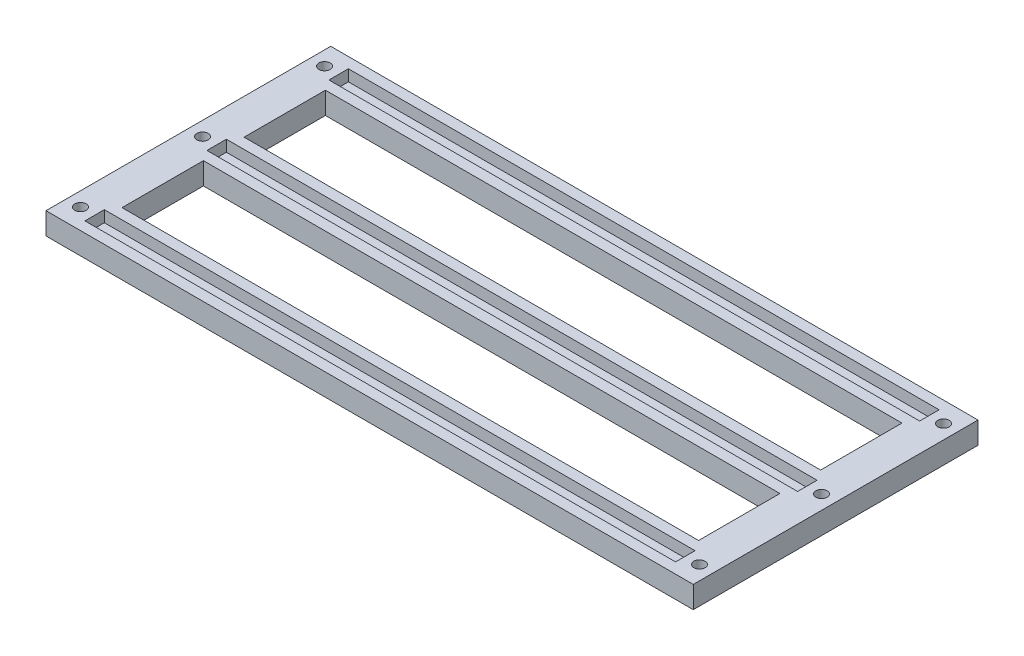
ISO-10303-21;
HEADER;
FILE_DESCRIPTION(('STEP AP214'),'2;1');
FILE_NAME('part.step','',(''),(''),'','','');
FILE_SCHEMA(('AUTOMOTIVE_DESIGN { 1 0 10303 214 1 1 1 1 }'));
ENDSEC;
DATA;
#1=APPLICATION_CONTEXT('core data for automotive mechanical design processes');
#2=APPLICATION_PROTOCOL_DEFINITION('international standard','automotive_design',2000,#1);
#3=PRODUCT_CONTEXT('',#1,'mechanical');
#4=PRODUCT('Part','Part','',(#3));
#5=PRODUCT_RELATED_PRODUCT_CATEGORY('part','',(#4));
#6=PRODUCT_DEFINITION_FORMATION('','',#4);
#7=PRODUCT_DEFINITION_CONTEXT('part definition',#1,'design');
#8=PRODUCT_DEFINITION('design','',#6,#7);
#9=PRODUCT_DEFINITION_SHAPE('','',#8);
#10=(LENGTH_UNIT() NAMED_UNIT(*) SI_UNIT(.MILLI.,.METRE.));
#11=(NAMED_UNIT(*) PLANE_ANGLE_UNIT() SI_UNIT($,.RADIAN.));
#12=(NAMED_UNIT(*) SI_UNIT($,.STERADIAN.) SOLID_ANGLE_UNIT());
#13=UNCERTAINTY_MEASURE_WITH_UNIT(LENGTH_MEASURE(1.E-05),#10,'distance_accuracy_value','');
#14=(GEOMETRIC_REPRESENTATION_CONTEXT(3) GLOBAL_UNCERTAINTY_ASSIGNED_CONTEXT((#13)) GLOBAL_UNIT_ASSIGNED_CONTEXT((#10,
#11,#12)) REPRESENTATION_CONTEXT('',''));
#15=CARTESIAN_POINT('',(0.,0.,0.));
#16=DIRECTION('',(0.,0.,1.));
#17=DIRECTION('',(1.,0.,0.));
#18=AXIS2_PLACEMENT_3D('',#15,#16,#17);
#19=CARTESIAN_POINT('',(-4.18172630706234E-13,3.2,-40.25));
#20=DIRECTION('',(0.,0.,-1.));
#21=DIRECTION('',(-1.,0.,0.));
#22=AXIS2_PLACEMENT_3D('',#19,#20,#21);
#23=PLANE('',#22);
#24=DIRECTION('',(0.,-1.,0.));
#25=VECTOR('',#24,1.);
#26=CARTESIAN_POINT('',(91.4999999999996,3.2,-40.250000000001));
#27=LINE('',#26,#25);
#28=CARTESIAN_POINT('',(91.4999999999996,3.2,-40.250000000001));
#29=VERTEX_POINT('',#28);
#30=CARTESIAN_POINT('',(91.4999999999996,-3.,-40.250000000001));
#31=VERTEX_POINT('',#30);
#32=EDGE_CURVE('E266',#29,#31,#27,.T.);
#33=ORIENTED_EDGE('',*,*,#32,.T.);
#34=DIRECTION('',(1.,0.,0.));
#35=VECTOR('',#34,1.);
#36=CARTESIAN_POINT('',(-4.18172630706234E-13,-3.,-40.25));
#37=LINE('',#36,#35);
#38=CARTESIAN_POINT('',(-91.5000000000004,-3.,-40.249999999999));
#39=VERTEX_POINT('',#38);
#40=EDGE_CURVE('E401',#39,#31,#37,.T.);
#41=ORIENTED_EDGE('',*,*,#40,.F.);
#42=DIRECTION('',(0.,-1.,0.));
#43=VECTOR('',#42,1.);
#44=CARTESIAN_POINT('',(-91.5000000000004,3.2,-40.249999999999));
#45=LINE('',#44,#43);
#46=CARTESIAN_POINT('',(-91.5000000000004,3.2,-40.249999999999));
#47=VERTEX_POINT('',#46);
#48=EDGE_CURVE('E11',#47,#39,#45,.T.);
#49=ORIENTED_EDGE('',*,*,#48,.F.);
#50=DIRECTION('',(1.,0.,0.));
#51=VECTOR('',#50,1.);
#52=CARTESIAN_POINT('',(-4.18172630706234E-13,3.2,-40.25));
#53=LINE('',#52,#51);
#54=EDGE_CURVE('E188',#47,#29,#53,.T.);
#55=ORIENTED_EDGE('',*,*,#54,.T.);
#56=EDGE_LOOP('',(#33,#41,#49,#55));
#57=FACE_BOUND('',#56,.T.);
#58=ADVANCED_FACE('F47',(#57),#23,.T.);
#59=CARTESIAN_POINT('',(-91.5,3.2,9.46447889004986E-13));
#60=DIRECTION('',(-1.,0.,0.));
#61=DIRECTION('',(0.,0.,1.));
#62=AXIS2_PLACEMENT_3D('',#59,#60,#61);
#63=PLANE('',#62);
#64=ORIENTED_EDGE('',*,*,#48,.T.);
#65=DIRECTION('',(0.,0.,-1.));
#66=VECTOR('',#65,1.);
#67=CARTESIAN_POINT('',(-91.5,-3.,9.46447889004986E-13));
#68=LINE('',#67,#66);
#69=CARTESIAN_POINT('',(-91.4999999999996,-3.,40.250000000001));
#70=VERTEX_POINT('',#69);
#71=EDGE_CURVE('E172',#70,#39,#68,.T.);
#72=ORIENTED_EDGE('',*,*,#71,.F.);
#73=DIRECTION('',(0.,-1.,0.));
#74=VECTOR('',#73,1.);
#75=CARTESIAN_POINT('',(-91.4999999999996,3.2,40.250000000001));
#76=LINE('',#75,#74);
#77=CARTESIAN_POINT('',(-91.4999999999996,3.2,40.250000000001));
#78=VERTEX_POINT('',#77);
#79=EDGE_CURVE('E58',#78,#70,#76,.T.);
#80=ORIENTED_EDGE('',*,*,#79,.F.);
#81=DIRECTION('',(0.,0.,-1.));
#82=VECTOR('',#81,1.);
#83=CARTESIAN_POINT('',(-91.5,3.2,9.46447889004986E-13));
#84=LINE('',#83,#82);
#85=EDGE_CURVE('E169',#78,#47,#84,.T.);
#86=ORIENTED_EDGE('',*,*,#85,.T.);
#87=EDGE_LOOP('',(#64,#72,#80,#86));
#88=FACE_BOUND('',#87,.T.);
#89=ADVANCED_FACE('F167',(#88),#63,.T.);
#90=CARTESIAN_POINT('',(4.18172630706234E-13,3.2,40.25));
#91=DIRECTION('',(0.,0.,-1.));
#92=DIRECTION('',(-1.,0.,0.));
#93=AXIS2_PLACEMENT_3D('',#90,#91,#92);
#94=PLANE('',#93);
#95=ORIENTED_EDGE('',*,*,#79,.T.);
#96=DIRECTION('',(1.,0.,0.));
#97=VECTOR('',#96,1.);
#98=CARTESIAN_POINT('',(4.18172630706234E-13,-3.,40.25));
#99=LINE('',#98,#97);
#100=CARTESIAN_POINT('',(91.5000000000004,-3.,40.249999999999));
#101=VERTEX_POINT('',#100);
#102=EDGE_CURVE('E403',#70,#101,#99,.T.);
#103=ORIENTED_EDGE('',*,*,#102,.T.);
#104=DIRECTION('',(0.,-1.,0.));
#105=VECTOR('',#104,1.);
#106=CARTESIAN_POINT('',(91.5000000000004,3.2,40.249999999999));
#107=LINE('',#106,#105);
#108=CARTESIAN_POINT('',(91.5000000000004,3.2,40.249999999999));
#109=VERTEX_POINT('',#108);
#110=EDGE_CURVE('E177',#109,#101,#107,.T.);
#111=ORIENTED_EDGE('',*,*,#110,.F.);
#112=DIRECTION('',(1.,0.,0.));
#113=VECTOR('',#112,1.);
#114=CARTESIAN_POINT('',(4.18172630706234E-13,3.2,40.25));
#115=LINE('',#114,#113);
#116=EDGE_CURVE('E180',#78,#109,#115,.T.);
#117=ORIENTED_EDGE('',*,*,#116,.F.);
#118=EDGE_LOOP('',(#95,#103,#111,#117));
#119=FACE_BOUND('',#118,.T.);
#120=ADVANCED_FACE('F181',(#119),#94,.F.);
#121=CARTESIAN_POINT('',(2.61067209517773E-11,3.2,-31.7500000000659));
#122=DIRECTION('',(8.22258927613325E-13,0.,-1.));
#123=DIRECTION('',(-1.,0.,-8.22258927613325E-13));
#124=AXIS2_PLACEMENT_3D('',#121,#122,#123);
#125=PLANE('',#124);
#126=DIRECTION('',(1.,0.,8.22258927613325E-13));
#127=VECTOR('',#126,1.);
#128=CARTESIAN_POINT('',(2.61067209517773E-11,0.,-31.7500000000659));
#129=LINE('',#128,#127);
#130=CARTESIAN_POINT('',(-83.5000000000002,0.,-31.7499999999964));
#131=VERTEX_POINT('',#130);
#132=CARTESIAN_POINT('',(83.4999999999996,0.,-31.7499999999972));
#133=VERTEX_POINT('',#132);
#134=EDGE_CURVE('E252',#131,#133,#129,.T.);
#135=ORIENTED_EDGE('',*,*,#134,.F.);
#136=DIRECTION('',(0.,-1.,0.));
#137=VECTOR('',#136,1.);
#138=CARTESIAN_POINT('',(-83.5000000000002,3.2,-31.7499999999964));
#139=LINE('',#138,#137);
#140=CARTESIAN_POINT('',(-83.5000000000002,3.2,-31.7499999999964));
#141=VERTEX_POINT('',#140);
#142=EDGE_CURVE('E270',#141,#131,#139,.T.);
#143=ORIENTED_EDGE('',*,*,#142,.F.);
#144=DIRECTION('',(1.,0.,8.22258927613325E-13));
#145=VECTOR('',#144,1.);
#146=CARTESIAN_POINT('',(2.61067209517773E-11,3.2,-31.7500000000659));
#147=LINE('',#146,#145);
#148=CARTESIAN_POINT('',(83.4999999999996,3.2,-31.7499999999972));
#149=VERTEX_POINT('',#148);
#150=EDGE_CURVE('E525',#141,#149,#147,.T.);
#151=ORIENTED_EDGE('',*,*,#150,.T.);
#152=DIRECTION('',(0.,-1.,0.));
#153=VECTOR('',#152,1.);
#154=CARTESIAN_POINT('',(83.4999999999996,3.2,-31.7499999999972));
#155=LINE('',#154,#153);
#156=EDGE_CURVE('E273',#149,#133,#155,.T.);
#157=ORIENTED_EDGE('',*,*,#156,.T.);
#158=EDGE_LOOP('',(#135,#143,#151,#157));
#159=FACE_BOUND('',#158,.T.);
#160=ADVANCED_FACE('F553',(#159),#125,.T.);
#161=CARTESIAN_POINT('',(-83.4999999999999,3.2,8.42760205056368E-13));
#162=DIRECTION('',(-1.,0.,0.));
#163=DIRECTION('',(0.,0.,1.));
#164=AXIS2_PLACEMENT_3D('',#161,#162,#163);
#165=PLANE('',#164);
#166=DIRECTION('',(0.,0.,-1.));
#167=VECTOR('',#166,1.);
#168=CARTESIAN_POINT('',(-83.4999999999999,0.,8.42760205056368E-13));
#169=LINE('',#168,#167);
#170=CARTESIAN_POINT('',(-83.5000000000003,0.,-37.2499999999964));
#171=VERTEX_POINT('',#170);
#172=EDGE_CURVE('E256',#131,#171,#169,.T.);
#173=ORIENTED_EDGE('',*,*,#172,.T.);
#174=DIRECTION('',(0.,-1.,0.));
#175=VECTOR('',#174,1.);
#176=CARTESIAN_POINT('',(-83.5000000000003,3.2,-37.2499999999964));
#177=LINE('',#176,#175);
#178=CARTESIAN_POINT('',(-83.5000000000003,3.2,-37.2499999999964));
#179=VERTEX_POINT('',#178);
#180=EDGE_CURVE('E282',#179,#171,#177,.T.);
#181=ORIENTED_EDGE('',*,*,#180,.F.);
#182=DIRECTION('',(0.,0.,-1.));
#183=VECTOR('',#182,1.);
#184=CARTESIAN_POINT('',(-83.4999999999999,3.2,8.42760205056368E-13));
#185=LINE('',#184,#183);
#186=EDGE_CURVE('E529',#141,#179,#185,.T.);
#187=ORIENTED_EDGE('',*,*,#186,.F.);
#188=ORIENTED_EDGE('',*,*,#142,.T.);
#189=EDGE_LOOP('',(#173,#181,#187,#188));
#190=FACE_BOUND('',#189,.T.);
#191=ADVANCED_FACE('F549',(#190),#165,.F.);
#192=CARTESIAN_POINT('',(2.01387560342978E-13,3.2,-37.249999999996));
#193=DIRECTION('',(0.,0.,-1.));
#194=DIRECTION('',(-1.,0.,0.));
#195=AXIS2_PLACEMENT_3D('',#192,#193,#194);
#196=PLANE('',#195);
#197=DIRECTION('',(1.,0.,0.));
#198=VECTOR('',#197,1.);
#199=CARTESIAN_POINT('',(2.01387560342978E-13,0.,-37.249999999996));
#200=LINE('',#199,#198);
#201=CARTESIAN_POINT('',(83.4999999999995,0.,-37.2499999999981));
#202=VERTEX_POINT('',#201);
#203=EDGE_CURVE('E90',#171,#202,#200,.T.);
#204=ORIENTED_EDGE('',*,*,#203,.T.);
#205=DIRECTION('',(0.,-1.,0.));
#206=VECTOR('',#205,1.);
#207=CARTESIAN_POINT('',(83.4999999999995,3.2,-37.2499999999981));
#208=LINE('',#207,#206);
#209=CARTESIAN_POINT('',(83.4999999999995,3.2,-37.2499999999981));
#210=VERTEX_POINT('',#209);
#211=EDGE_CURVE('E277',#210,#202,#208,.T.);
#212=ORIENTED_EDGE('',*,*,#211,.F.);
#213=DIRECTION('',(1.,0.,0.));
#214=VECTOR('',#213,1.);
#215=CARTESIAN_POINT('',(2.01387560342978E-13,3.2,-37.249999999996));
#216=LINE('',#215,#214);
#217=EDGE_CURVE('E533',#179,#210,#216,.T.);
#218=ORIENTED_EDGE('',*,*,#217,.F.);
#219=ORIENTED_EDGE('',*,*,#180,.T.);
#220=EDGE_LOOP('',(#204,#212,#218,#219));
#221=FACE_BOUND('',#220,.T.);
#222=ADVANCED_FACE('F547',(#221),#196,.F.);
#223=CARTESIAN_POINT('',(0.,3.2,-5.75000000000002));
#224=DIRECTION('',(0.,0.,-1.));
#225=DIRECTION('',(-1.,0.,0.));
#226=AXIS2_PLACEMENT_3D('',#223,#224,#225);
#227=PLANE('',#226);
#228=DIRECTION('',(0.,-1.,0.));
#229=VECTOR('',#228,1.);
#230=CARTESIAN_POINT('',(81.4999999999967,3.2,-5.75000000000002));
#231=LINE('',#230,#229);
#232=CARTESIAN_POINT('',(81.4999999999967,3.2,-5.75000000000002));
#233=VERTEX_POINT('',#232);
#234=CARTESIAN_POINT('',(81.4999999999967,-3.,-5.75000000000002));
#235=VERTEX_POINT('',#234);
#236=EDGE_CURVE('E288',#233,#235,#231,.T.);
#237=ORIENTED_EDGE('',*,*,#236,.T.);
#238=DIRECTION('',(1.,0.,0.));
#239=VECTOR('',#238,1.);
#240=CARTESIAN_POINT('',(0.,-3.,-5.75000000000002));
#241=LINE('',#240,#239);
#242=CARTESIAN_POINT('',(-81.4999999999999,-3.,-5.75000000000002));
#243=VERTEX_POINT('',#242);
#244=EDGE_CURVE('E414',#243,#235,#241,.T.);
#245=ORIENTED_EDGE('',*,*,#244,.F.);
#246=DIRECTION('',(0.,-1.,0.));
#247=VECTOR('',#246,1.);
#248=CARTESIAN_POINT('',(-81.4999999999999,3.2,-5.75000000000002));
#249=LINE('',#248,#247);
#250=CARTESIAN_POINT('',(-81.4999999999999,3.2,-5.75000000000002));
#251=VERTEX_POINT('',#250);
#252=EDGE_CURVE('E278',#251,#243,#249,.T.);
#253=ORIENTED_EDGE('',*,*,#252,.F.);
#254=DIRECTION('',(1.,0.,0.));
#255=VECTOR('',#254,1.);
#256=CARTESIAN_POINT('',(0.,3.2,-5.75000000000002));
#257=LINE('',#256,#255);
#258=EDGE_CURVE('E510',#251,#233,#257,.T.);
#259=ORIENTED_EDGE('',*,*,#258,.T.);
#260=EDGE_LOOP('',(#237,#245,#253,#259));
#261=FACE_BOUND('',#260,.T.);
#262=ADVANCED_FACE('F576',(#261),#227,.T.);
#263=CARTESIAN_POINT('',(-81.4999999999997,3.2,3.01610588356241E-12));
#264=DIRECTION('',(-1.,0.,0.));
#265=DIRECTION('',(0.,0.,1.));
#266=AXIS2_PLACEMENT_3D('',#263,#264,#265);
#267=PLANE('',#266);
#268=ORIENTED_EDGE('',*,*,#252,.T.);
#269=DIRECTION('',(0.,0.,-1.));
#270=VECTOR('',#269,1.);
#271=CARTESIAN_POINT('',(-81.4999999999997,-3.,3.01610588356241E-12));
#272=LINE('',#271,#270);
#273=CARTESIAN_POINT('',(-81.5000000000005,-3.,-28.7499999999992));
#274=VERTEX_POINT('',#273);
#275=EDGE_CURVE('E418',#243,#274,#272,.T.);
#276=ORIENTED_EDGE('',*,*,#275,.T.);
#277=DIRECTION('',(0.,-1.,0.));
#278=VECTOR('',#277,1.);
#279=CARTESIAN_POINT('',(-81.5000000000005,3.2,-28.7499999999992));
#280=LINE('',#279,#278);
#281=CARTESIAN_POINT('',(-81.5000000000005,3.2,-28.7499999999992));
#282=VERTEX_POINT('',#281);
#283=EDGE_CURVE('E297',#282,#274,#280,.T.);
#284=ORIENTED_EDGE('',*,*,#283,.F.);
#285=DIRECTION('',(0.,0.,-1.));
#286=VECTOR('',#285,1.);
#287=CARTESIAN_POINT('',(-81.4999999999997,3.2,3.01610588356241E-12));
#288=LINE('',#287,#286);
#289=EDGE_CURVE('E514',#251,#282,#288,.T.);
#290=ORIENTED_EDGE('',*,*,#289,.F.);
#291=EDGE_LOOP('',(#268,#276,#284,#290));
#292=FACE_BOUND('',#291,.T.);
#293=ADVANCED_FACE('F580',(#292),#267,.F.);
#294=CARTESIAN_POINT('',(-2.99851741936482E-13,3.2,-28.75));
#295=DIRECTION('',(0.,0.,-1.));
#296=DIRECTION('',(-1.,0.,0.));
#297=AXIS2_PLACEMENT_3D('',#294,#295,#296);
#298=PLANE('',#297);
#299=ORIENTED_EDGE('',*,*,#283,.T.);
#300=DIRECTION('',(1.,0.,0.));
#301=VECTOR('',#300,1.);
#302=CARTESIAN_POINT('',(-2.99851741936482E-13,-3.,-28.75));
#303=LINE('',#302,#301);
#304=CARTESIAN_POINT('',(81.4999999999996,-3.,-28.7500000000009));
#305=VERTEX_POINT('',#304);
#306=EDGE_CURVE('E422',#274,#305,#303,.T.);
#307=ORIENTED_EDGE('',*,*,#306,.T.);
#308=DIRECTION('',(0.,-1.,0.));
#309=VECTOR('',#308,1.);
#310=CARTESIAN_POINT('',(81.4999999999996,3.2,-28.7500000000009));
#311=LINE('',#310,#309);
#312=CARTESIAN_POINT('',(81.4999999999996,3.2,-28.7500000000009));
#313=VERTEX_POINT('',#312);
#314=EDGE_CURVE('E292',#313,#305,#311,.T.);
#315=ORIENTED_EDGE('',*,*,#314,.F.);
#316=DIRECTION('',(1.,0.,0.));
#317=VECTOR('',#316,1.);
#318=CARTESIAN_POINT('',(-2.99851741936482E-13,3.2,-28.75));
#319=LINE('',#318,#317);
#320=EDGE_CURVE('E518',#282,#313,#319,.T.);
#321=ORIENTED_EDGE('',*,*,#320,.F.);
#322=EDGE_LOOP('',(#299,#307,#315,#321));
#323=FACE_BOUND('',#322,.T.);
#324=ADVANCED_FACE('F586',(#323),#298,.F.);
#325=CARTESIAN_POINT('',(-4.63691585105338E-12,3.2,2.74999999986176));
#326=DIRECTION('',(1.68615121864963E-12,0.,-1.));
#327=DIRECTION('',(-1.,0.,-1.68615121864963E-12));
#328=AXIS2_PLACEMENT_3D('',#325,#326,#327);
#329=PLANE('',#328);
#330=DIRECTION('',(1.,0.,1.68615121864963E-12));
#331=VECTOR('',#330,1.);
#332=CARTESIAN_POINT('',(-4.63691585105338E-12,0.,2.74999999986176));
#333=LINE('',#332,#331);
#334=CARTESIAN_POINT('',(-83.4999999999998,0.,2.75000000000256));
#335=VERTEX_POINT('',#334);
#336=CARTESIAN_POINT('',(83.5000000000005,0.,2.75000000000255));
#337=VERTEX_POINT('',#336);
#338=EDGE_CURVE('E239',#335,#337,#333,.T.);
#339=ORIENTED_EDGE('',*,*,#338,.F.);
#340=DIRECTION('',(0.,-1.,0.));
#341=VECTOR('',#340,1.);
#342=CARTESIAN_POINT('',(-83.4999999999998,3.2,2.75000000000256));
#343=LINE('',#342,#341);
#344=CARTESIAN_POINT('',(-83.4999999999998,3.2,2.75000000000256));
#345=VERTEX_POINT('',#344);
#346=EDGE_CURVE('E293',#345,#335,#343,.T.);
#347=ORIENTED_EDGE('',*,*,#346,.F.);
#348=DIRECTION('',(1.,0.,1.68615121864963E-12));
#349=VECTOR('',#348,1.);
#350=CARTESIAN_POINT('',(-4.63691585105338E-12,3.2,2.74999999986176));
#351=LINE('',#350,#349);
#352=CARTESIAN_POINT('',(83.5000000000005,3.2,2.75000000000255));
#353=VERTEX_POINT('',#352);
#354=EDGE_CURVE('E495',#345,#353,#351,.T.);
#355=ORIENTED_EDGE('',*,*,#354,.T.);
#356=DIRECTION('',(0.,-1.,0.));
#357=VECTOR('',#356,1.);
#358=CARTESIAN_POINT('',(83.5000000000005,3.2,2.75000000000255));
#359=LINE('',#358,#357);
#360=EDGE_CURVE('E304',#353,#337,#359,.T.);
#361=ORIENTED_EDGE('',*,*,#360,.T.);
#362=EDGE_LOOP('',(#339,#347,#355,#361));
#363=FACE_BOUND('',#362,.T.);
#364=ADVANCED_FACE('F604',(#363),#329,.T.);
#365=CARTESIAN_POINT('',(-83.4999999999998,3.2,-2.10690051264092E-13));
#366=DIRECTION('',(-1.,0.,0.));
#367=DIRECTION('',(0.,0.,1.));
#368=AXIS2_PLACEMENT_3D('',#365,#366,#367);
#369=PLANE('',#368);
#370=DIRECTION('',(0.,0.,-1.));
#371=VECTOR('',#370,1.);
#372=CARTESIAN_POINT('',(-83.4999999999998,0.,-2.10690051264092E-13));
#373=LINE('',#372,#371);
#374=CARTESIAN_POINT('',(-83.4999999999998,0.,-2.74999999999743));
#375=VERTEX_POINT('',#374);
#376=EDGE_CURVE('E243',#335,#375,#373,.T.);
#377=ORIENTED_EDGE('',*,*,#376,.T.);
#378=DIRECTION('',(0.,-1.,0.));
#379=VECTOR('',#378,1.);
#380=CARTESIAN_POINT('',(-83.4999999999998,3.2,-2.74999999999743));
#381=LINE('',#380,#379);
#382=CARTESIAN_POINT('',(-83.4999999999998,3.2,-2.74999999999743));
#383=VERTEX_POINT('',#382);
#384=EDGE_CURVE('E313',#383,#375,#381,.T.);
#385=ORIENTED_EDGE('',*,*,#384,.F.);
#386=DIRECTION('',(0.,0.,-1.));
#387=VECTOR('',#386,1.);
#388=CARTESIAN_POINT('',(-83.4999999999998,3.2,-2.10690051264092E-13));
#389=LINE('',#388,#387);
#390=EDGE_CURVE('E499',#345,#383,#389,.T.);
#391=ORIENTED_EDGE('',*,*,#390,.F.);
#392=ORIENTED_EDGE('',*,*,#346,.T.);
#393=EDGE_LOOP('',(#377,#385,#391,#392));
#394=FACE_BOUND('',#393,.T.);
#395=ADVANCED_FACE('F600',(#394),#369,.F.);
#396=CARTESIAN_POINT('',(0.,3.2,-2.74999999999775));
#397=DIRECTION('',(0.,0.,1.));
#398=DIRECTION('',(1.,0.,0.));
#399=AXIS2_PLACEMENT_3D('',#396,#397,#398);
#400=PLANE('',#399);
#401=DIRECTION('',(-1.,0.,0.));
#402=VECTOR('',#401,1.);
#403=CARTESIAN_POINT('',(0.,0.,-2.74999999999775));
#404=LINE('',#403,#402);
#405=CARTESIAN_POINT('',(83.5000000000005,0.,-2.74999999999746));
#406=VERTEX_POINT('',#405);
#407=EDGE_CURVE('E82',#406,#375,#404,.T.);
#408=ORIENTED_EDGE('',*,*,#407,.F.);
#409=DIRECTION('',(0.,-1.,0.));
#410=VECTOR('',#409,1.);
#411=CARTESIAN_POINT('',(83.5000000000005,3.2,-2.74999999999746));
#412=LINE('',#411,#410);
#413=CARTESIAN_POINT('',(83.5000000000005,3.2,-2.74999999999746));
#414=VERTEX_POINT('',#413);
#415=EDGE_CURVE('E308',#414,#406,#412,.T.);
#416=ORIENTED_EDGE('',*,*,#415,.F.);
#417=DIRECTION('',(-1.,0.,0.));
#418=VECTOR('',#417,1.);
#419=CARTESIAN_POINT('',(0.,3.2,-2.74999999999775));
#420=LINE('',#419,#418);
#421=EDGE_CURVE('E502',#414,#383,#420,.T.);
#422=ORIENTED_EDGE('',*,*,#421,.T.);
#423=ORIENTED_EDGE('',*,*,#384,.T.);
#424=EDGE_LOOP('',(#408,#416,#422,#423));
#425=FACE_BOUND('',#424,.T.);
#426=ADVANCED_FACE('F596',(#425),#400,.T.);
#427=CARTESIAN_POINT('',(0.,3.2,28.7500000000008));
#428=DIRECTION('',(0.,0.,-1.));
#429=DIRECTION('',(-1.,0.,0.));
#430=AXIS2_PLACEMENT_3D('',#427,#428,#429);
#431=PLANE('',#430);
#432=DIRECTION('',(0.,-1.,0.));
#433=VECTOR('',#432,1.);
#434=CARTESIAN_POINT('',(81.4999999999969,3.2,28.7500000000008));
#435=LINE('',#434,#433);
#436=CARTESIAN_POINT('',(81.4999999999969,3.2,28.7500000000008));
#437=VERTEX_POINT('',#436);
#438=CARTESIAN_POINT('',(81.4999999999969,-3.,28.7500000000008));
#439=VERTEX_POINT('',#438);
#440=EDGE_CURVE('E319',#437,#439,#435,.T.);
#441=ORIENTED_EDGE('',*,*,#440,.T.);
#442=DIRECTION('',(1.,0.,0.));
#443=VECTOR('',#442,1.);
#444=CARTESIAN_POINT('',(0.,-3.,28.7500000000008));
#445=LINE('',#444,#443);
#446=CARTESIAN_POINT('',(-81.4999999999998,-3.,28.7500000000008));
#447=VERTEX_POINT('',#446);
#448=EDGE_CURVE('E430',#447,#439,#445,.T.);
#449=ORIENTED_EDGE('',*,*,#448,.F.);
#450=DIRECTION('',(0.,-1.,0.));
#451=VECTOR('',#450,1.);
#452=CARTESIAN_POINT('',(-81.4999999999998,3.2,28.7500000000008));
#453=LINE('',#452,#451);
#454=CARTESIAN_POINT('',(-81.4999999999998,3.2,28.7500000000008));
#455=VERTEX_POINT('',#454);
#456=EDGE_CURVE('E309',#455,#447,#453,.T.);
#457=ORIENTED_EDGE('',*,*,#456,.F.);
#458=DIRECTION('',(1.,0.,0.));
#459=VECTOR('',#458,1.);
#460=CARTESIAN_POINT('',(0.,3.2,28.7500000000008));
#461=LINE('',#460,#459);
#462=EDGE_CURVE('E480',#455,#437,#461,.T.);
#463=ORIENTED_EDGE('',*,*,#462,.T.);
#464=EDGE_LOOP('',(#441,#449,#457,#463));
#465=FACE_BOUND('',#464,.T.);
#466=ADVANCED_FACE('F599',(#465),#431,.T.);
#467=CARTESIAN_POINT('',(-81.4999999999878,3.2,-3.35541779546366E-11));
#468=DIRECTION('',(-1.,0.,-4.11707704964928E-13));
#469=DIRECTION('',(-4.11707704964928E-13,0.,1.));
#470=AXIS2_PLACEMENT_3D('',#467,#468,#469);
#471=PLANE('',#470);
#472=ORIENTED_EDGE('',*,*,#456,.T.);
#473=DIRECTION('',(4.11707704964928E-13,0.,-1.));
#474=VECTOR('',#473,1.);
#475=CARTESIAN_POINT('',(-81.4999999999878,-3.,-3.35541779546366E-11));
#476=LINE('',#475,#474);
#477=CARTESIAN_POINT('',(-81.4999999999951,-3.,5.75));
#478=VERTEX_POINT('',#477);
#479=EDGE_CURVE('E434',#447,#478,#476,.T.);
#480=ORIENTED_EDGE('',*,*,#479,.T.);
#481=DIRECTION('',(0.,-1.,0.));
#482=VECTOR('',#481,1.);
#483=CARTESIAN_POINT('',(-81.4999999999951,3.2,5.75));
#484=LINE('',#483,#482);
#485=CARTESIAN_POINT('',(-81.4999999999951,3.2,5.75));
#486=VERTEX_POINT('',#485);
#487=EDGE_CURVE('E327',#486,#478,#484,.T.);
#488=ORIENTED_EDGE('',*,*,#487,.F.);
#489=DIRECTION('',(4.11707704964928E-13,0.,-1.));
#490=VECTOR('',#489,1.);
#491=CARTESIAN_POINT('',(-81.4999999999878,3.2,-3.35541779546366E-11));
#492=LINE('',#491,#490);
#493=EDGE_CURVE('E484',#455,#486,#492,.T.);
#494=ORIENTED_EDGE('',*,*,#493,.F.);
#495=EDGE_LOOP('',(#472,#480,#488,#494));
#496=FACE_BOUND('',#495,.T.);
#497=ADVANCED_FACE('F616',(#496),#471,.F.);
#498=CARTESIAN_POINT('',(0.,3.2,5.75));
#499=DIRECTION('',(0.,0.,-1.));
#500=DIRECTION('',(-1.,0.,0.));
#501=AXIS2_PLACEMENT_3D('',#498,#499,#500);
#502=PLANE('',#501);
#503=ORIENTED_EDGE('',*,*,#487,.T.);
#504=DIRECTION('',(1.,0.,0.));
#505=VECTOR('',#504,1.);
#506=CARTESIAN_POINT('',(0.,-3.,5.75));
#507=LINE('',#506,#505);
#508=CARTESIAN_POINT('',(81.4999999999999,-3.,5.75));
#509=VERTEX_POINT('',#508);
#510=EDGE_CURVE('E438',#478,#509,#507,.T.);
#511=ORIENTED_EDGE('',*,*,#510,.T.);
#512=DIRECTION('',(0.,-1.,0.));
#513=VECTOR('',#512,1.);
#514=CARTESIAN_POINT('',(81.4999999999999,3.2,5.75));
#515=LINE('',#514,#513);
#516=CARTESIAN_POINT('',(81.4999999999999,3.2,5.75));
#517=VERTEX_POINT('',#516);
#518=EDGE_CURVE('E323',#517,#509,#515,.T.);
#519=ORIENTED_EDGE('',*,*,#518,.F.);
#520=DIRECTION('',(1.,0.,0.));
#521=VECTOR('',#520,1.);
#522=CARTESIAN_POINT('',(0.,3.2,5.75));
#523=LINE('',#522,#521);
#524=EDGE_CURVE('E488',#486,#517,#523,.T.);
#525=ORIENTED_EDGE('',*,*,#524,.F.);
#526=EDGE_LOOP('',(#503,#511,#519,#525));
#527=FACE_BOUND('',#526,.T.);
#528=ADVANCED_FACE('F613',(#527),#502,.F.);
#529=CARTESIAN_POINT('',(-3.06291450535422E-11,3.2,37.2499999999341));
#530=DIRECTION('',(8.22258927613325E-13,0.,-1.));
#531=DIRECTION('',(-1.,0.,-8.22258927613325E-13));
#532=AXIS2_PLACEMENT_3D('',#529,#530,#531);
#533=PLANE('',#532);
#534=DIRECTION('',(1.,0.,8.22258927613325E-13));
#535=VECTOR('',#534,1.);
#536=CARTESIAN_POINT('',(-3.06291450535422E-11,0.,37.2499999999341));
#537=LINE('',#536,#535);
#538=CARTESIAN_POINT('',(-83.4999999999995,0.,37.2500000000045));
#539=VERTEX_POINT('',#538);
#540=CARTESIAN_POINT('',(83.5000000000003,0.,37.2500000000028));
#541=VERTEX_POINT('',#540);
#542=EDGE_CURVE('E223',#539,#541,#537,.T.);
#543=ORIENTED_EDGE('',*,*,#542,.F.);
#544=DIRECTION('',(0.,-1.,0.));
#545=VECTOR('',#544,1.);
#546=CARTESIAN_POINT('',(-83.4999999999995,3.2,37.2500000000045));
#547=LINE('',#546,#545);
#548=CARTESIAN_POINT('',(-83.4999999999995,3.2,37.2500000000045));
#549=VERTEX_POINT('',#548);
#550=EDGE_CURVE('E51',#549,#539,#547,.T.);
#551=ORIENTED_EDGE('',*,*,#550,.F.);
#552=DIRECTION('',(1.,0.,8.22258927613325E-13));
#553=VECTOR('',#552,1.);
#554=CARTESIAN_POINT('',(-3.06291450535422E-11,3.2,37.2499999999341));
#555=LINE('',#554,#553);
#556=CARTESIAN_POINT('',(83.5000000000003,3.2,37.2500000000028));
#557=VERTEX_POINT('',#556);
#558=EDGE_CURVE('E265',#549,#557,#555,.T.);
#559=ORIENTED_EDGE('',*,*,#558,.T.);
#560=DIRECTION('',(0.,-1.,0.));
#561=VECTOR('',#560,1.);
#562=CARTESIAN_POINT('',(83.5000000000003,3.2,37.2500000000028));
#563=LINE('',#562,#561);
#564=EDGE_CURVE('E222',#557,#541,#563,.T.);
#565=ORIENTED_EDGE('',*,*,#564,.T.);
#566=EDGE_LOOP('',(#543,#551,#559,#565));
#567=FACE_BOUND('',#566,.T.);
#568=ADVANCED_FACE('F49',(#567),#533,.T.);
#569=CARTESIAN_POINT('',(-83.4999999999999,3.2,8.42760205056367E-13));
#570=DIRECTION('',(-1.,0.,0.));
#571=DIRECTION('',(0.,0.,1.));
#572=AXIS2_PLACEMENT_3D('',#569,#570,#571);
#573=PLANE('',#572);
#574=DIRECTION('',(0.,0.,-1.));
#575=VECTOR('',#574,1.);
#576=CARTESIAN_POINT('',(-83.4999999999999,0.,8.42760205056367E-13));
#577=LINE('',#576,#575);
#578=CARTESIAN_POINT('',(-83.4999999999996,0.,31.7500000000045));
#579=VERTEX_POINT('',#578);
#580=EDGE_CURVE('E227',#539,#579,#577,.T.);
#581=ORIENTED_EDGE('',*,*,#580,.T.);
#582=DIRECTION('',(0.,-1.,0.));
#583=VECTOR('',#582,1.);
#584=CARTESIAN_POINT('',(-83.4999999999996,3.2,31.7500000000045));
#585=LINE('',#584,#583);
#586=CARTESIAN_POINT('',(-83.4999999999996,3.2,31.7500000000045));
#587=VERTEX_POINT('',#586);
#588=EDGE_CURVE('E340',#587,#579,#585,.T.);
#589=ORIENTED_EDGE('',*,*,#588,.F.);
#590=DIRECTION('',(0.,0.,-1.));
#591=VECTOR('',#590,1.);
#592=CARTESIAN_POINT('',(-83.4999999999999,3.2,8.42760205056367E-13));
#593=LINE('',#592,#591);
#594=EDGE_CURVE('E352',#549,#587,#593,.T.);
#595=ORIENTED_EDGE('',*,*,#594,.F.);
#596=ORIENTED_EDGE('',*,*,#550,.T.);
#597=EDGE_LOOP('',(#581,#589,#595,#596));
#598=FACE_BOUND('',#597,.T.);
#599=ADVANCED_FACE('F350',(#598),#573,.F.);
#600=CARTESIAN_POINT('',(2.67676505961322E-11,3.2,31.7500000000732));
#601=DIRECTION('',(8.43075609325055E-13,0.,1.));
#602=DIRECTION('',(1.,0.,-8.43075609325055E-13));
#603=AXIS2_PLACEMENT_3D('',#600,#601,#602);
#604=PLANE('',#603);
#605=DIRECTION('',(-1.,0.,8.43075609325055E-13));
#606=VECTOR('',#605,1.);
#607=CARTESIAN_POINT('',(2.67676505961322E-11,0.,31.7500000000732));
#608=LINE('',#607,#606);
#609=CARTESIAN_POINT('',(83.5000000000002,0.,31.7500000000028));
#610=VERTEX_POINT('',#609);
#611=EDGE_CURVE('E232',#610,#579,#608,.T.);
#612=ORIENTED_EDGE('',*,*,#611,.F.);
#613=DIRECTION('',(0.,-1.,0.));
#614=VECTOR('',#613,1.);
#615=CARTESIAN_POINT('',(83.5000000000002,3.2,31.7500000000028));
#616=LINE('',#615,#614);
#617=CARTESIAN_POINT('',(83.5000000000002,3.2,31.7500000000028));
#618=VERTEX_POINT('',#617);
#619=EDGE_CURVE('E337',#618,#610,#616,.T.);
#620=ORIENTED_EDGE('',*,*,#619,.F.);
#621=DIRECTION('',(-1.,0.,8.43075609325055E-13));
#622=VECTOR('',#621,1.);
#623=CARTESIAN_POINT('',(2.67676505961322E-11,3.2,31.7500000000732));
#624=LINE('',#623,#622);
#625=EDGE_CURVE('E473',#618,#587,#624,.T.);
#626=ORIENTED_EDGE('',*,*,#625,.T.);
#627=ORIENTED_EDGE('',*,*,#588,.T.);
#628=EDGE_LOOP('',(#612,#620,#626,#627));
#629=FACE_BOUND('',#628,.T.);
#630=ADVANCED_FACE('F628',(#629),#604,.T.);
#631=CARTESIAN_POINT('',(-87.4999999999996,3.2,-34.4999999999973));
#632=DIRECTION('',(0.,-1.,0.));
#633=DIRECTION('',(0.,0.,-1.));
#634=AXIS2_PLACEMENT_3D('',#631,#632,#633);
#635=CYLINDRICAL_SURFACE('',#634,1.60000000000028);
#636=CARTESIAN_POINT('',(-87.4999999999996,3.2,-34.4999999999973));
#637=DIRECTION('',(0.,1.,0.));
#638=DIRECTION('',(0.,0.,1.));
#639=AXIS2_PLACEMENT_3D('',#636,#637,#638);
#640=CIRCLE('',#639,1.60000000000028);
#641=CARTESIAN_POINT('',(-87.4999999999996,3.2,-32.899999999997));
#642=VERTEX_POINT('',#641);
#643=EDGE_CURVE('E214',#642,#642,#640,.F.);
#644=ORIENTED_EDGE('',*,*,#643,.F.);
#645=EDGE_LOOP('',(#644));
#646=FACE_BOUND('',#645,.T.);
#647=CARTESIAN_POINT('',(-87.4999999999996,-3.,-34.4999999999973));
#648=DIRECTION('',(0.,1.,0.));
#649=DIRECTION('',(0.,0.,1.));
#650=AXIS2_PLACEMENT_3D('',#647,#648,#649);
#651=CIRCLE('',#650,1.60000000000028);
#652=CARTESIAN_POINT('',(-87.4999999999996,-3.,-32.899999999997));
#653=VERTEX_POINT('',#652);
#654=EDGE_CURVE('E462',#653,#653,#651,.F.);
#655=ORIENTED_EDGE('',*,*,#654,.T.);
#656=EDGE_LOOP('',(#655));
#657=FACE_BOUND('',#656,.T.);
#658=ADVANCED_FACE('F630',(#646,#657),#635,.F.);
#659=CARTESIAN_POINT('',(-87.4999999999992,3.2,8.11850586757146E-13));
#660=DIRECTION('',(0.,-1.,0.));
#661=DIRECTION('',(0.,0.,-1.));
#662=AXIS2_PLACEMENT_3D('',#659,#660,#661);
#663=CYLINDRICAL_SURFACE('',#662,1.60000000000001);
#664=CARTESIAN_POINT('',(-87.4999999999992,3.2,8.11850586757146E-13));
#665=DIRECTION('',(0.,1.,0.));
#666=DIRECTION('',(0.,0.,1.));
#667=AXIS2_PLACEMENT_3D('',#664,#665,#666);
#668=CIRCLE('',#667,1.60000000000001);
#669=CARTESIAN_POINT('',(-87.4999999999992,3.2,1.60000000000082));
#670=VERTEX_POINT('',#669);
#671=EDGE_CURVE('E210',#670,#670,#668,.F.);
#672=ORIENTED_EDGE('',*,*,#671,.F.);
#673=EDGE_LOOP('',(#672));
#674=FACE_BOUND('',#673,.T.);
#675=CARTESIAN_POINT('',(-87.4999999999992,-3.,8.11850586757146E-13));
#676=DIRECTION('',(0.,1.,0.));
#677=DIRECTION('',(0.,0.,1.));
#678=AXIS2_PLACEMENT_3D('',#675,#676,#677);
#679=CIRCLE('',#678,1.60000000000001);
#680=CARTESIAN_POINT('',(-87.4999999999992,-3.,1.60000000000082));
#681=VERTEX_POINT('',#680);
#682=EDGE_CURVE('E458',#681,#681,#679,.F.);
#683=ORIENTED_EDGE('',*,*,#682,.T.);
#684=EDGE_LOOP('',(#683));
#685=FACE_BOUND('',#684,.T.);
#686=ADVANCED_FACE('F866',(#674,#685),#663,.F.);
#687=CARTESIAN_POINT('',(87.4999999999996,3.2,-34.4999999999982));
#688=DIRECTION('',(0.,-1.,0.));
#689=DIRECTION('',(0.,0.,-1.));
#690=AXIS2_PLACEMENT_3D('',#687,#688,#689);
#691=CYLINDRICAL_SURFACE('',#690,1.5999999999998);
#692=CARTESIAN_POINT('',(87.4999999999996,3.2,-34.4999999999982));
#693=DIRECTION('',(0.,1.,0.));
#694=DIRECTION('',(0.,0.,1.));
#695=AXIS2_PLACEMENT_3D('',#692,#693,#694);
#696=CIRCLE('',#695,1.5999999999998);
#697=CARTESIAN_POINT('',(87.4999999999996,3.2,-32.8999999999984));
#698=VERTEX_POINT('',#697);
#699=EDGE_CURVE('E206',#698,#698,#696,.T.);
#700=ORIENTED_EDGE('',*,*,#699,.T.);
#701=EDGE_LOOP('',(#700));
#702=FACE_BOUND('',#701,.T.);
#703=CARTESIAN_POINT('',(87.4999999999996,-3.,-34.4999999999982));
#704=DIRECTION('',(0.,1.,0.));
#705=DIRECTION('',(0.,0.,1.));
#706=AXIS2_PLACEMENT_3D('',#703,#704,#705);
#707=CIRCLE('',#706,1.5999999999998);
#708=CARTESIAN_POINT('',(87.4999999999996,-3.,-32.8999999999984));
#709=VERTEX_POINT('',#708);
#710=EDGE_CURVE('E454',#709,#709,#707,.T.);
#711=ORIENTED_EDGE('',*,*,#710,.F.);
#712=EDGE_LOOP('',(#711));
#713=FACE_BOUND('',#712,.T.);
#714=ADVANCED_FACE('F854',(#702,#713),#691,.F.);
#715=CARTESIAN_POINT('',(87.4999999999999,3.2,8.11850586757146E-13));
#716=DIRECTION('',(0.,-1.,0.));
#717=DIRECTION('',(0.,0.,-1.));
#718=AXIS2_PLACEMENT_3D('',#715,#716,#717);
#719=CYLINDRICAL_SURFACE('',#718,1.60000000000001);
#720=CARTESIAN_POINT('',(87.4999999999999,3.2,8.11850586757146E-13));
#721=DIRECTION('',(0.,1.,0.));
#722=DIRECTION('',(0.,0.,1.));
#723=AXIS2_PLACEMENT_3D('',#720,#721,#722);
#724=CIRCLE('',#723,1.60000000000001);
#725=CARTESIAN_POINT('',(87.4999999999999,3.2,1.60000000000082));
#726=VERTEX_POINT('',#725);
#727=EDGE_CURVE('E202',#726,#726,#724,.T.);
#728=ORIENTED_EDGE('',*,*,#727,.T.);
#729=EDGE_LOOP('',(#728));
#730=FACE_BOUND('',#729,.T.);
#731=CARTESIAN_POINT('',(87.4999999999999,-3.,8.11850586757146E-13));
#732=DIRECTION('',(0.,1.,0.));
#733=DIRECTION('',(0.,0.,1.));
#734=AXIS2_PLACEMENT_3D('',#731,#732,#733);
#735=CIRCLE('',#734,1.60000000000001);
#736=CARTESIAN_POINT('',(87.4999999999999,-3.,1.60000000000082));
#737=VERTEX_POINT('',#736);
#738=EDGE_CURVE('E450',#737,#737,#735,.T.);
#739=ORIENTED_EDGE('',*,*,#738,.F.);
#740=EDGE_LOOP('',(#739));
#741=FACE_BOUND('',#740,.T.);
#742=ADVANCED_FACE('F842',(#730,#741),#719,.F.);
#743=CARTESIAN_POINT('',(87.5000000000003,3.2,34.5000000000008));
#744=DIRECTION('',(0.,-1.,0.));
#745=DIRECTION('',(0.,0.,-1.));
#746=AXIS2_PLACEMENT_3D('',#743,#744,#745);
#747=CYLINDRICAL_SURFACE('',#746,1.60000000000001);
#748=CARTESIAN_POINT('',(87.5000000000003,3.2,34.5000000000008));
#749=DIRECTION('',(0.,1.,0.));
#750=DIRECTION('',(0.,0.,1.));
#751=AXIS2_PLACEMENT_3D('',#748,#749,#750);
#752=CIRCLE('',#751,1.60000000000001);
#753=CARTESIAN_POINT('',(87.5000000000003,3.2,36.1000000000008));
#754=VERTEX_POINT('',#753);
#755=EDGE_CURVE('E198',#754,#754,#752,.T.);
#756=ORIENTED_EDGE('',*,*,#755,.T.);
#757=EDGE_LOOP('',(#756));
#758=FACE_BOUND('',#757,.T.);
#759=CARTESIAN_POINT('',(87.5000000000003,-3.,34.5000000000008));
#760=DIRECTION('',(0.,1.,0.));
#761=DIRECTION('',(0.,0.,1.));
#762=AXIS2_PLACEMENT_3D('',#759,#760,#761);
#763=CIRCLE('',#762,1.60000000000001);
#764=CARTESIAN_POINT('',(87.5000000000003,-3.,36.1000000000008));
#765=VERTEX_POINT('',#764);
#766=EDGE_CURVE('E446',#765,#765,#763,.T.);
#767=ORIENTED_EDGE('',*,*,#766,.F.);
#768=EDGE_LOOP('',(#767));
#769=FACE_BOUND('',#768,.T.);
#770=ADVANCED_FACE('F830',(#758,#769),#747,.F.);
#771=CARTESIAN_POINT('',(91.5,3.2,-9.46447889004986E-13));
#772=DIRECTION('',(-1.,0.,0.));
#773=DIRECTION('',(0.,0.,1.));
#774=AXIS2_PLACEMENT_3D('',#771,#772,#773);
#775=PLANE('',#774);
#776=ORIENTED_EDGE('',*,*,#110,.T.);
#777=DIRECTION('',(0.,0.,-1.));
#778=VECTOR('',#777,1.);
#779=CARTESIAN_POINT('',(91.5,-3.,-9.46447889004986E-13));
#780=LINE('',#779,#778);
#781=EDGE_CURVE('E411',#101,#31,#780,.T.);
#782=ORIENTED_EDGE('',*,*,#781,.T.);
#783=ORIENTED_EDGE('',*,*,#32,.F.);
#784=DIRECTION('',(0.,0.,-1.));
#785=VECTOR('',#784,1.);
#786=CARTESIAN_POINT('',(91.5,3.2,-9.46447889004986E-13));
#787=LINE('',#786,#785);
#788=EDGE_CURVE('E67',#109,#29,#787,.T.);
#789=ORIENTED_EDGE('',*,*,#788,.F.);
#790=EDGE_LOOP('',(#776,#782,#783,#789));
#791=FACE_BOUND('',#790,.T.);
#792=ADVANCED_FACE('F574',(#791),#775,.F.);
#793=CARTESIAN_POINT('',(83.5000000000001,3.2,-1.47483035884841E-12));
#794=DIRECTION('',(-1.,0.,0.));
#795=DIRECTION('',(0.,0.,1.));
#796=AXIS2_PLACEMENT_3D('',#793,#794,#795);
#797=PLANE('',#796);
#798=DIRECTION('',(0.,0.,-1.));
#799=VECTOR('',#798,1.);
#800=CARTESIAN_POINT('',(83.5000000000001,0.,-1.47483035884841E-12));
#801=LINE('',#800,#799);
#802=EDGE_CURVE('E262',#133,#202,#801,.T.);
#803=ORIENTED_EDGE('',*,*,#802,.F.);
#804=ORIENTED_EDGE('',*,*,#156,.F.);
#805=DIRECTION('',(0.,0.,-1.));
#806=VECTOR('',#805,1.);
#807=CARTESIAN_POINT('',(83.5000000000001,3.2,-1.47483035884841E-12));
#808=LINE('',#807,#806);
#809=EDGE_CURVE('E192',#149,#210,#808,.T.);
#810=ORIENTED_EDGE('',*,*,#809,.T.);
#811=ORIENTED_EDGE('',*,*,#211,.T.);
#812=EDGE_LOOP('',(#803,#804,#810,#811));
#813=FACE_BOUND('',#812,.T.);
#814=ADVANCED_FACE('F540',(#813),#797,.T.);
#815=CARTESIAN_POINT('',(81.499999999992,3.2,2.14897544204126E-11));
#816=DIRECTION('',(-1.,0.,-2.63677968348647E-13));
#817=DIRECTION('',(-2.63677968348647E-13,0.,1.));
#818=AXIS2_PLACEMENT_3D('',#815,#816,#817);
#819=PLANE('',#818);
#820=ORIENTED_EDGE('',*,*,#314,.T.);
#821=DIRECTION('',(2.63677968348647E-13,0.,-1.));
#822=VECTOR('',#821,1.);
#823=CARTESIAN_POINT('',(81.499999999992,-3.,2.14897544204126E-11));
#824=LINE('',#823,#822);
#825=EDGE_CURVE('E426',#235,#305,#824,.T.);
#826=ORIENTED_EDGE('',*,*,#825,.F.);
#827=ORIENTED_EDGE('',*,*,#236,.F.);
#828=DIRECTION('',(2.63677968348647E-13,0.,-1.));
#829=VECTOR('',#828,1.);
#830=CARTESIAN_POINT('',(81.499999999992,3.2,2.14897544204126E-11));
#831=LINE('',#830,#829);
#832=EDGE_CURVE('E521',#233,#313,#831,.T.);
#833=ORIENTED_EDGE('',*,*,#832,.T.);
#834=EDGE_LOOP('',(#820,#826,#827,#833));
#835=FACE_BOUND('',#834,.T.);
#836=ADVANCED_FACE('F573',(#835),#819,.T.);
#837=CARTESIAN_POINT('',(83.5000000000005,3.2,0.));
#838=DIRECTION('',(-1.,0.,0.));
#839=DIRECTION('',(0.,0.,1.));
#840=AXIS2_PLACEMENT_3D('',#837,#838,#839);
#841=PLANE('',#840);
#842=DIRECTION('',(0.,0.,-1.));
#843=VECTOR('',#842,1.);
#844=CARTESIAN_POINT('',(83.5000000000005,0.,0.));
#845=LINE('',#844,#843);
#846=EDGE_CURVE('E249',#337,#406,#845,.T.);
#847=ORIENTED_EDGE('',*,*,#846,.F.);
#848=ORIENTED_EDGE('',*,*,#360,.F.);
#849=DIRECTION('',(0.,0.,-1.));
#850=VECTOR('',#849,1.);
#851=CARTESIAN_POINT('',(83.5000000000005,3.2,0.));
#852=LINE('',#851,#850);
#853=EDGE_CURVE('E506',#353,#414,#852,.T.);
#854=ORIENTED_EDGE('',*,*,#853,.T.);
#855=ORIENTED_EDGE('',*,*,#415,.T.);
#856=EDGE_LOOP('',(#847,#848,#854,#855));
#857=FACE_BOUND('',#856,.T.);
#858=ADVANCED_FACE('F591',(#857),#841,.T.);
#859=CARTESIAN_POINT('',(81.5000000000014,3.2,2.18667676558407E-11));
#860=DIRECTION('',(-1.,0.,-2.68303897617672E-13));
#861=DIRECTION('',(-2.68303897617672E-13,0.,1.));
#862=AXIS2_PLACEMENT_3D('',#859,#860,#861);
#863=PLANE('',#862);
#864=ORIENTED_EDGE('',*,*,#518,.T.);
#865=DIRECTION('',(2.68303897617672E-13,0.,-1.));
#866=VECTOR('',#865,1.);
#867=CARTESIAN_POINT('',(81.5000000000014,-3.,2.18667676558407E-11));
#868=LINE('',#867,#866);
#869=EDGE_CURVE('E442',#439,#509,#868,.T.);
#870=ORIENTED_EDGE('',*,*,#869,.F.);
#871=ORIENTED_EDGE('',*,*,#440,.F.);
#872=DIRECTION('',(2.68303897617672E-13,0.,-1.));
#873=VECTOR('',#872,1.);
#874=CARTESIAN_POINT('',(81.5000000000014,3.2,2.18667676558407E-11));
#875=LINE('',#874,#873);
#876=EDGE_CURVE('E491',#437,#517,#875,.T.);
#877=ORIENTED_EDGE('',*,*,#876,.T.);
#878=EDGE_LOOP('',(#864,#870,#871,#877));
#879=FACE_BOUND('',#878,.T.);
#880=ADVANCED_FACE('F594',(#879),#863,.T.);
#881=CARTESIAN_POINT('',(83.4999999999999,3.2,-8.42760205056374E-13));
#882=DIRECTION('',(-1.,0.,0.));
#883=DIRECTION('',(0.,0.,1.));
#884=AXIS2_PLACEMENT_3D('',#881,#882,#883);
#885=PLANE('',#884);
#886=DIRECTION('',(0.,0.,-1.));
#887=VECTOR('',#886,1.);
#888=CARTESIAN_POINT('',(83.4999999999999,0.,-8.42760205056374E-13));
#889=LINE('',#888,#887);
#890=EDGE_CURVE('E235',#541,#610,#889,.T.);
#891=ORIENTED_EDGE('',*,*,#890,.F.);
#892=ORIENTED_EDGE('',*,*,#564,.F.);
#893=DIRECTION('',(0.,0.,-1.));
#894=VECTOR('',#893,1.);
#895=CARTESIAN_POINT('',(83.4999999999999,3.2,-8.42760205056374E-13));
#896=LINE('',#895,#894);
#897=EDGE_CURVE('E476',#557,#618,#896,.T.);
#898=ORIENTED_EDGE('',*,*,#897,.T.);
#899=ORIENTED_EDGE('',*,*,#619,.T.);
#900=EDGE_LOOP('',(#891,#892,#898,#899));
#901=FACE_BOUND('',#900,.T.);
#902=ADVANCED_FACE('F611',(#901),#885,.T.);
#903=CARTESIAN_POINT('',(-87.4999999999988,3.2,34.5000000000008));
#904=DIRECTION('',(0.,-1.,0.));
#905=DIRECTION('',(0.,0.,-1.));
#906=AXIS2_PLACEMENT_3D('',#903,#904,#905);
#907=CYLINDRICAL_SURFACE('',#906,1.60000000000001);
#908=CARTESIAN_POINT('',(-87.4999999999988,3.2,34.5000000000008));
#909=DIRECTION('',(0.,1.,0.));
#910=DIRECTION('',(0.,0.,1.));
#911=AXIS2_PLACEMENT_3D('',#908,#909,#910);
#912=CIRCLE('',#911,1.60000000000001);
#913=CARTESIAN_POINT('',(-87.4999999999988,3.2,36.1000000000008));
#914=VERTEX_POINT('',#913);
#915=EDGE_CURVE('E218',#914,#914,#912,.F.);
#916=ORIENTED_EDGE('',*,*,#915,.F.);
#917=EDGE_LOOP('',(#916));
#918=FACE_BOUND('',#917,.T.);
#919=CARTESIAN_POINT('',(-87.4999999999988,-3.,34.5000000000008));
#920=DIRECTION('',(0.,1.,0.));
#921=DIRECTION('',(0.,0.,1.));
#922=AXIS2_PLACEMENT_3D('',#919,#920,#921);
#923=CIRCLE('',#922,1.60000000000001);
#924=CARTESIAN_POINT('',(-87.4999999999988,-3.,36.1000000000008));
#925=VERTEX_POINT('',#924);
#926=EDGE_CURVE('E228',#925,#925,#923,.F.);
#927=ORIENTED_EDGE('',*,*,#926,.T.);
#928=EDGE_LOOP('',(#927));
#929=FACE_BOUND('',#928,.T.);
#930=ADVANCED_FACE('F626',(#918,#929),#907,.F.);
#931=CARTESIAN_POINT('',(0.,3.2,0.));
#932=DIRECTION('',(0.,1.,0.));
#933=DIRECTION('',(0.,0.,1.));
#934=AXIS2_PLACEMENT_3D('',#931,#932,#933);
#935=PLANE('',#934);
#936=ORIENTED_EDGE('',*,*,#558,.F.);
#937=ORIENTED_EDGE('',*,*,#594,.T.);
#938=ORIENTED_EDGE('',*,*,#625,.F.);
#939=ORIENTED_EDGE('',*,*,#897,.F.);
#940=EDGE_LOOP('',(#936,#937,#938,#939));
#941=FACE_BOUND('',#940,.T.);
#942=ORIENTED_EDGE('',*,*,#462,.F.);
#943=ORIENTED_EDGE('',*,*,#493,.T.);
#944=ORIENTED_EDGE('',*,*,#524,.T.);
#945=ORIENTED_EDGE('',*,*,#876,.F.);
#946=EDGE_LOOP('',(#942,#943,#944,#945));
#947=FACE_BOUND('',#946,.T.);
#948=ORIENTED_EDGE('',*,*,#354,.F.);
#949=ORIENTED_EDGE('',*,*,#390,.T.);
#950=ORIENTED_EDGE('',*,*,#421,.F.);
#951=ORIENTED_EDGE('',*,*,#853,.F.);
#952=EDGE_LOOP('',(#948,#949,#950,#951));
#953=FACE_BOUND('',#952,.T.);
#954=ORIENTED_EDGE('',*,*,#258,.F.);
#955=ORIENTED_EDGE('',*,*,#289,.T.);
#956=ORIENTED_EDGE('',*,*,#320,.T.);
#957=ORIENTED_EDGE('',*,*,#832,.F.);
#958=EDGE_LOOP('',(#954,#955,#956,#957));
#959=FACE_BOUND('',#958,.T.);
#960=ORIENTED_EDGE('',*,*,#150,.F.);
#961=ORIENTED_EDGE('',*,*,#186,.T.);
#962=ORIENTED_EDGE('',*,*,#217,.T.);
#963=ORIENTED_EDGE('',*,*,#809,.F.);
#964=EDGE_LOOP('',(#960,#961,#962,#963));
#965=FACE_BOUND('',#964,.T.);
#966=ORIENTED_EDGE('',*,*,#54,.F.);
#967=ORIENTED_EDGE('',*,*,#85,.F.);
#968=ORIENTED_EDGE('',*,*,#116,.T.);
#969=ORIENTED_EDGE('',*,*,#788,.T.);
#970=EDGE_LOOP('',(#966,#967,#968,#969));
#971=FACE_BOUND('',#970,.T.);
#972=ORIENTED_EDGE('',*,*,#755,.F.);
#973=EDGE_LOOP('',(#972));
#974=FACE_BOUND('',#973,.T.);
#975=ORIENTED_EDGE('',*,*,#727,.F.);
#976=EDGE_LOOP('',(#975));
#977=FACE_BOUND('',#976,.T.);
#978=ORIENTED_EDGE('',*,*,#699,.F.);
#979=EDGE_LOOP('',(#978));
#980=FACE_BOUND('',#979,.T.);
#981=ORIENTED_EDGE('',*,*,#671,.T.);
#982=EDGE_LOOP('',(#981));
#983=FACE_BOUND('',#982,.T.);
#984=ORIENTED_EDGE('',*,*,#643,.T.);
#985=EDGE_LOOP('',(#984));
#986=FACE_BOUND('',#985,.T.);
#987=ORIENTED_EDGE('',*,*,#915,.T.);
#988=EDGE_LOOP('',(#987));
#989=FACE_BOUND('',#988,.T.);
#990=ADVANCED_FACE('F185',(#941,#947,#953,#959,#965,#971,#974,#977,#980,#983,#986,#989),#935,.T.);
#991=CARTESIAN_POINT('',(0.,0.,0.));
#992=DIRECTION('',(0.,1.,0.));
#993=DIRECTION('',(0.,0.,1.));
#994=AXIS2_PLACEMENT_3D('',#991,#992,#993);
#995=PLANE('',#994);
#996=ORIENTED_EDGE('',*,*,#172,.F.);
#997=ORIENTED_EDGE('',*,*,#134,.T.);
#998=ORIENTED_EDGE('',*,*,#802,.T.);
#999=ORIENTED_EDGE('',*,*,#203,.F.);
#1000=EDGE_LOOP('',(#996,#997,#998,#999));
#1001=FACE_BOUND('',#1000,.T.);
#1002=ADVANCED_FACE('F551',(#1001),#995,.T.);
#1003=ORIENTED_EDGE('',*,*,#376,.F.);
#1004=ORIENTED_EDGE('',*,*,#338,.T.);
#1005=ORIENTED_EDGE('',*,*,#846,.T.);
#1006=ORIENTED_EDGE('',*,*,#407,.T.);
#1007=EDGE_LOOP('',(#1003,#1004,#1005,#1006));
#1008=FACE_BOUND('',#1007,.T.);
#1009=ADVANCED_FACE('F1013',(#1008),#995,.T.);
#1010=ORIENTED_EDGE('',*,*,#580,.F.);
#1011=ORIENTED_EDGE('',*,*,#542,.T.);
#1012=ORIENTED_EDGE('',*,*,#890,.T.);
#1013=ORIENTED_EDGE('',*,*,#611,.T.);
#1014=EDGE_LOOP('',(#1010,#1011,#1012,#1013));
#1015=FACE_BOUND('',#1014,.T.);
#1016=ADVANCED_FACE('F359',(#1015),#995,.T.);
#1017=CARTESIAN_POINT('',(0.,-3.,0.));
#1018=DIRECTION('',(0.,1.,0.));
#1019=DIRECTION('',(0.,0.,1.));
#1020=AXIS2_PLACEMENT_3D('',#1017,#1018,#1019);
#1021=PLANE('',#1020);
#1022=ORIENTED_EDGE('',*,*,#40,.T.);
#1023=ORIENTED_EDGE('',*,*,#781,.F.);
#1024=ORIENTED_EDGE('',*,*,#102,.F.);
#1025=ORIENTED_EDGE('',*,*,#71,.T.);
#1026=EDGE_LOOP('',(#1022,#1023,#1024,#1025));
#1027=FACE_BOUND('',#1026,.T.);
#1028=ORIENTED_EDGE('',*,*,#244,.T.);
#1029=ORIENTED_EDGE('',*,*,#825,.T.);
#1030=ORIENTED_EDGE('',*,*,#306,.F.);
#1031=ORIENTED_EDGE('',*,*,#275,.F.);
#1032=EDGE_LOOP('',(#1028,#1029,#1030,#1031));
#1033=FACE_BOUND('',#1032,.T.);
#1034=ORIENTED_EDGE('',*,*,#448,.T.);
#1035=ORIENTED_EDGE('',*,*,#869,.T.);
#1036=ORIENTED_EDGE('',*,*,#510,.F.);
#1037=ORIENTED_EDGE('',*,*,#479,.F.);
#1038=EDGE_LOOP('',(#1034,#1035,#1036,#1037));
#1039=FACE_BOUND('',#1038,.T.);
#1040=ORIENTED_EDGE('',*,*,#766,.T.);
#1041=EDGE_LOOP('',(#1040));
#1042=FACE_BOUND('',#1041,.T.);
#1043=ORIENTED_EDGE('',*,*,#738,.T.);
#1044=EDGE_LOOP('',(#1043));
#1045=FACE_BOUND('',#1044,.T.);
#1046=ORIENTED_EDGE('',*,*,#710,.T.);
#1047=EDGE_LOOP('',(#1046));
#1048=FACE_BOUND('',#1047,.T.);
#1049=ORIENTED_EDGE('',*,*,#682,.F.);
#1050=EDGE_LOOP('',(#1049));
#1051=FACE_BOUND('',#1050,.T.);
#1052=ORIENTED_EDGE('',*,*,#654,.F.);
#1053=EDGE_LOOP('',(#1052));
#1054=FACE_BOUND('',#1053,.T.);
#1055=ORIENTED_EDGE('',*,*,#926,.F.);
#1056=EDGE_LOOP('',(#1055));
#1057=FACE_BOUND('',#1056,.T.);
#1058=ADVANCED_FACE('F398',(#1027,#1033,#1039,#1042,#1045,#1048,#1051,#1054,#1057),#1021,.F.);
#1059=CLOSED_SHELL('',(#58,#89,#120,#160,#191,#222,#262,#293,#324,#364,#395,#426,#466,#497,#528,
#568,#599,#630,#658,#686,#714,#742,#770,#792,#814,#836,#858,#880,#902,#930,#990,#1002,#1009,
#1016,#1058));
#1060=MANIFOLD_SOLID_BREP('B2',#1059);
#1061=ADVANCED_BREP_SHAPE_REPRESENTATION('',(#18,#1060),#14);
#1062=SHAPE_DEFINITION_REPRESENTATION(#9,#1061);
ENDSEC;
END-ISO-10303-21;
